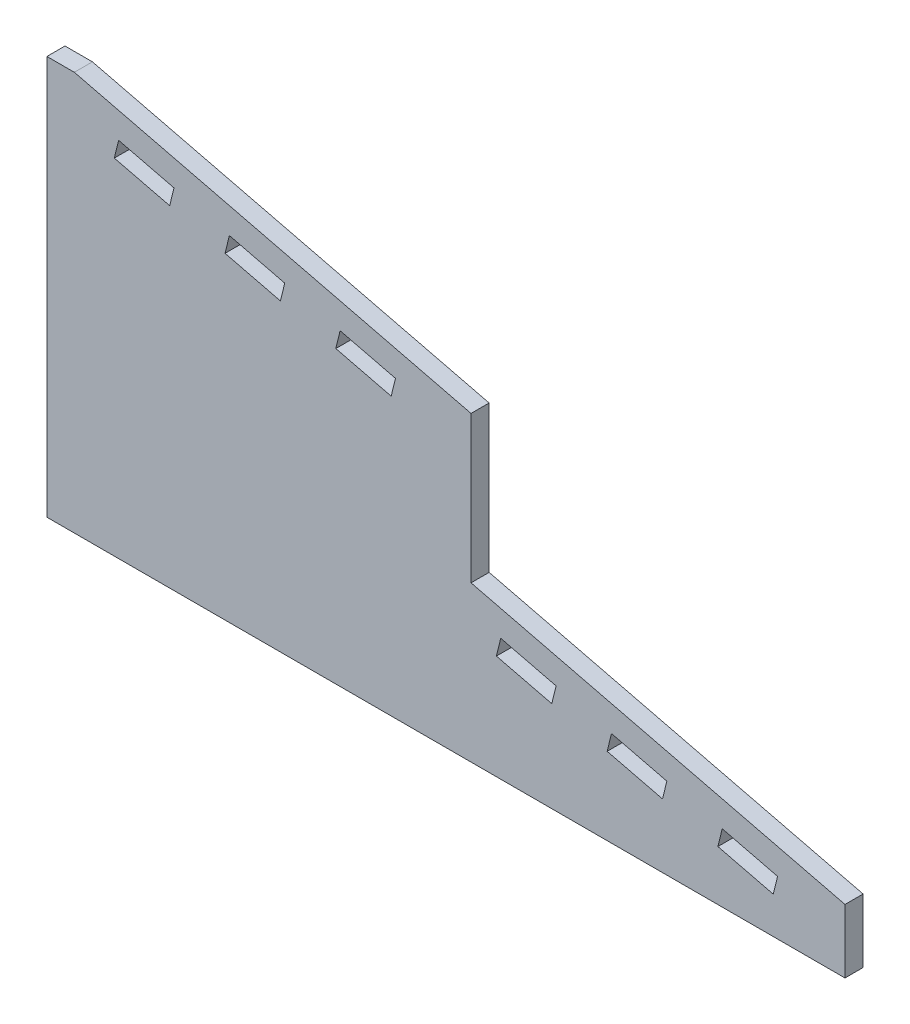
ISO-10303-21;
HEADER;
FILE_DESCRIPTION(('STEP AP214'),'2;1');
FILE_NAME('part.step','',(''),(''),'','','');
FILE_SCHEMA(('AUTOMOTIVE_DESIGN { 1 0 10303 214 1 1 1 1 }'));
ENDSEC;
DATA;
#1=APPLICATION_CONTEXT('core data for automotive mechanical design processes');
#2=APPLICATION_PROTOCOL_DEFINITION('international standard','automotive_design',2000,#1);
#3=PRODUCT_CONTEXT('',#1,'mechanical');
#4=PRODUCT('Part','Part','',(#3));
#5=PRODUCT_RELATED_PRODUCT_CATEGORY('part','',(#4));
#6=PRODUCT_DEFINITION_FORMATION('','',#4);
#7=PRODUCT_DEFINITION_CONTEXT('part definition',#1,'design');
#8=PRODUCT_DEFINITION('design','',#6,#7);
#9=PRODUCT_DEFINITION_SHAPE('','',#8);
#10=(LENGTH_UNIT() NAMED_UNIT(*) SI_UNIT(.MILLI.,.METRE.));
#11=(NAMED_UNIT(*) PLANE_ANGLE_UNIT() SI_UNIT($,.RADIAN.));
#12=(NAMED_UNIT(*) SI_UNIT($,.STERADIAN.) SOLID_ANGLE_UNIT());
#13=UNCERTAINTY_MEASURE_WITH_UNIT(LENGTH_MEASURE(1.E-05),#10,'distance_accuracy_value','');
#14=(GEOMETRIC_REPRESENTATION_CONTEXT(3) GLOBAL_UNCERTAINTY_ASSIGNED_CONTEXT((#13)) GLOBAL_UNIT_ASSIGNED_CONTEXT((#10,
#11,#12)) REPRESENTATION_CONTEXT('',''));
#15=CARTESIAN_POINT('',(0.,0.,0.));
#16=DIRECTION('',(0.,0.,1.));
#17=DIRECTION('',(1.,0.,0.));
#18=AXIS2_PLACEMENT_3D('',#15,#16,#17);
#19=CARTESIAN_POINT('',(0.,0.,3.175));
#20=DIRECTION('',(1.,0.,0.));
#21=DIRECTION('',(0.,0.,-1.));
#22=AXIS2_PLACEMENT_3D('',#19,#20,#21);
#23=PLANE('',#22);
#24=DIRECTION('',(0.,-1.,0.));
#25=VECTOR('',#24,1.);
#26=CARTESIAN_POINT('',(0.,0.,0.));
#27=LINE('',#26,#25);
#28=CARTESIAN_POINT('',(0.,70.,0.));
#29=VERTEX_POINT('',#28);
#30=CARTESIAN_POINT('',(0.,0.,0.));
#31=VERTEX_POINT('',#30);
#32=EDGE_CURVE('E264',#29,#31,#27,.T.);
#33=ORIENTED_EDGE('',*,*,#32,.T.);
#34=DIRECTION('',(0.,0.,-1.));
#35=VECTOR('',#34,1.);
#36=CARTESIAN_POINT('',(0.,0.,3.175));
#37=LINE('',#36,#35);
#38=CARTESIAN_POINT('',(0.,0.,3.175));
#39=VERTEX_POINT('',#38);
#40=EDGE_CURVE('E11',#39,#31,#37,.T.);
#41=ORIENTED_EDGE('',*,*,#40,.F.);
#42=DIRECTION('',(0.,-1.,0.));
#43=VECTOR('',#42,1.);
#44=CARTESIAN_POINT('',(0.,0.,3.175));
#45=LINE('',#44,#43);
#46=CARTESIAN_POINT('',(0.,70.,3.175));
#47=VERTEX_POINT('',#46);
#48=EDGE_CURVE('E262',#47,#39,#45,.T.);
#49=ORIENTED_EDGE('',*,*,#48,.F.);
#50=DIRECTION('',(0.,0.,-1.));
#51=VECTOR('',#50,1.);
#52=CARTESIAN_POINT('',(0.,70.,3.175));
#53=LINE('',#52,#51);
#54=EDGE_CURVE('E268',#47,#29,#53,.T.);
#55=ORIENTED_EDGE('',*,*,#54,.T.);
#56=EDGE_LOOP('',(#33,#41,#49,#55));
#57=FACE_BOUND('',#56,.T.);
#58=ADVANCED_FACE('F33',(#57),#23,.F.);
#59=CARTESIAN_POINT('',(0.,0.,3.175));
#60=DIRECTION('',(0.,1.,0.));
#61=DIRECTION('',(0.,0.,1.));
#62=AXIS2_PLACEMENT_3D('',#59,#60,#61);
#63=PLANE('',#62);
#64=DIRECTION('',(1.,0.,0.));
#65=VECTOR('',#64,1.);
#66=CARTESIAN_POINT('',(0.,0.,0.));
#67=LINE('',#66,#65);
#68=CARTESIAN_POINT('',(140.,0.,0.));
#69=VERTEX_POINT('',#68);
#70=EDGE_CURVE('E260',#31,#69,#67,.T.);
#71=ORIENTED_EDGE('',*,*,#70,.T.);
#72=DIRECTION('',(0.,0.,-1.));
#73=VECTOR('',#72,1.);
#74=CARTESIAN_POINT('',(140.,0.,3.175));
#75=LINE('',#74,#73);
#76=CARTESIAN_POINT('',(140.,0.,3.175));
#77=VERTEX_POINT('',#76);
#78=EDGE_CURVE('E40',#77,#69,#75,.T.);
#79=ORIENTED_EDGE('',*,*,#78,.F.);
#80=DIRECTION('',(1.,0.,0.));
#81=VECTOR('',#80,1.);
#82=CARTESIAN_POINT('',(0.,0.,3.175));
#83=LINE('',#82,#81);
#84=EDGE_CURVE('E282',#39,#77,#83,.T.);
#85=ORIENTED_EDGE('',*,*,#84,.F.);
#86=ORIENTED_EDGE('',*,*,#40,.T.);
#87=EDGE_LOOP('',(#71,#79,#85,#86));
#88=FACE_BOUND('',#87,.T.);
#89=ADVANCED_FACE('F464',(#88),#63,.F.);
#90=CARTESIAN_POINT('',(140.,0.,3.175));
#91=DIRECTION('',(-1.,0.,0.));
#92=DIRECTION('',(0.,0.,1.));
#93=AXIS2_PLACEMENT_3D('',#90,#91,#92);
#94=PLANE('',#93);
#95=DIRECTION('',(0.,1.,0.));
#96=VECTOR('',#95,1.);
#97=CARTESIAN_POINT('',(140.,0.,0.));
#98=LINE('',#97,#96);
#99=CARTESIAN_POINT('',(140.,11.177065891492,0.));
#100=VERTEX_POINT('',#99);
#101=EDGE_CURVE('E251',#69,#100,#98,.T.);
#102=ORIENTED_EDGE('',*,*,#101,.T.);
#103=DIRECTION('',(0.,0.,1.));
#104=VECTOR('',#103,1.);
#105=CARTESIAN_POINT('',(140.,11.177065891492,0.));
#106=LINE('',#105,#104);
#107=CARTESIAN_POINT('',(140.,11.177065891492,3.175));
#108=VERTEX_POINT('',#107);
#109=EDGE_CURVE('E235',#100,#108,#106,.T.);
#110=ORIENTED_EDGE('',*,*,#109,.T.);
#111=DIRECTION('',(0.,1.,0.));
#112=VECTOR('',#111,1.);
#113=CARTESIAN_POINT('',(140.,0.,3.175));
#114=LINE('',#113,#112);
#115=EDGE_CURVE('E276',#77,#108,#114,.T.);
#116=ORIENTED_EDGE('',*,*,#115,.F.);
#117=ORIENTED_EDGE('',*,*,#78,.T.);
#118=EDGE_LOOP('',(#102,#110,#116,#117));
#119=FACE_BOUND('',#118,.T.);
#120=ADVANCED_FACE('F257',(#119),#94,.F.);
#121=CARTESIAN_POINT('',(0.,70.,3.175));
#122=DIRECTION('',(0.,-1.,0.));
#123=DIRECTION('',(0.,0.,-1.));
#124=AXIS2_PLACEMENT_3D('',#121,#122,#123);
#125=PLANE('',#124);
#126=DIRECTION('',(-1.,0.,0.));
#127=VECTOR('',#126,1.);
#128=CARTESIAN_POINT('',(0.,70.,3.175));
#129=LINE('',#128,#127);
#130=CARTESIAN_POINT('',(4.80964743633403,70.,3.175));
#131=VERTEX_POINT('',#130);
#132=EDGE_CURVE('E270',#131,#47,#129,.T.);
#133=ORIENTED_EDGE('',*,*,#132,.F.);
#134=DIRECTION('',(0.,0.,1.));
#135=VECTOR('',#134,1.);
#136=CARTESIAN_POINT('',(4.80964743633403,70.,0.));
#137=LINE('',#136,#135);
#138=CARTESIAN_POINT('',(4.80964743633403,70.,0.));
#139=VERTEX_POINT('',#138);
#140=EDGE_CURVE('E245',#139,#131,#137,.T.);
#141=ORIENTED_EDGE('',*,*,#140,.F.);
#142=DIRECTION('',(-1.,0.,0.));
#143=VECTOR('',#142,1.);
#144=CARTESIAN_POINT('',(0.,70.,0.));
#145=LINE('',#144,#143);
#146=EDGE_CURVE('E259',#139,#29,#145,.T.);
#147=ORIENTED_EDGE('',*,*,#146,.T.);
#148=ORIENTED_EDGE('',*,*,#54,.F.);
#149=EDGE_LOOP('',(#133,#141,#147,#148));
#150=FACE_BOUND('',#149,.T.);
#151=ADVANCED_FACE('F468',(#150),#125,.F.);
#152=CARTESIAN_POINT('',(0.,0.,3.175));
#153=DIRECTION('',(0.,0.,-1.));
#154=DIRECTION('',(-1.,0.,0.));
#155=AXIS2_PLACEMENT_3D('',#152,#153,#154);
#156=PLANE('',#155);
#157=DIRECTION('',(-0.237714979344397,-0.971334951803595,0.));
#158=VECTOR('',#157,1.);
#159=CARTESIAN_POINT('',(12.5797173555219,63.5557121683706,3.175));
#160=LINE('',#159,#158);
#161=CARTESIAN_POINT('',(12.5797173555219,63.5557121683706,3.175));
#162=VERTEX_POINT('',#161);
#163=CARTESIAN_POINT('',(11.8249722961035,60.4717236963942,3.175));
#164=VERTEX_POINT('',#163);
#165=EDGE_CURVE('E488',#162,#164,#160,.T.);
#166=ORIENTED_EDGE('',*,*,#165,.F.);
#167=DIRECTION('',(-0.971334951803595,0.237714979344397,0.));
#168=VECTOR('',#167,1.);
#169=CARTESIAN_POINT('',(22.2930668735579,61.1785623749266,3.175));
#170=LINE('',#169,#168);
#171=CARTESIAN_POINT('',(22.2930668735579,61.1785623749266,3.175));
#172=VERTEX_POINT('',#171);
#173=EDGE_CURVE('E55',#172,#162,#170,.T.);
#174=ORIENTED_EDGE('',*,*,#173,.F.);
#175=DIRECTION('',(0.237714979344397,0.971334951803595,0.));
#176=VECTOR('',#175,1.);
#177=CARTESIAN_POINT('',(21.5383218141394,58.0945739029502,3.175));
#178=LINE('',#177,#176);
#179=CARTESIAN_POINT('',(21.5383218141394,58.0945739029502,3.175));
#180=VERTEX_POINT('',#179);
#181=EDGE_CURVE('E294',#180,#172,#178,.T.);
#182=ORIENTED_EDGE('',*,*,#181,.F.);
#183=DIRECTION('',(0.971334951803595,-0.237714979344397,0.));
#184=VECTOR('',#183,1.);
#185=CARTESIAN_POINT('',(11.8249722961035,60.4717236963942,3.175));
#186=LINE('',#185,#184);
#187=EDGE_CURVE('E490',#164,#180,#186,.T.);
#188=ORIENTED_EDGE('',*,*,#187,.F.);
#189=EDGE_LOOP('',(#166,#174,#182,#188));
#190=FACE_BOUND('',#189,.T.);
#191=DIRECTION('',(-0.237714979344392,-0.971334951803597,0.));
#192=VECTOR('',#191,1.);
#193=CARTESIAN_POINT('',(78.8535350542985,18.3300367988493,3.175));
#194=LINE('',#193,#192);
#195=CARTESIAN_POINT('',(79.6082801137169,21.4140252708257,3.175));
#196=VERTEX_POINT('',#195);
#197=CARTESIAN_POINT('',(78.8535350542985,18.3300367988493,3.175));
#198=VERTEX_POINT('',#197);
#199=EDGE_CURVE('E317',#196,#198,#194,.T.);
#200=ORIENTED_EDGE('',*,*,#199,.F.);
#201=DIRECTION('',(-0.971334951803595,0.237714979344397,0.));
#202=VECTOR('',#201,1.);
#203=CARTESIAN_POINT('',(79.6082801137169,21.4140252708257,3.175));
#204=LINE('',#203,#202);
#205=CARTESIAN_POINT('',(89.3216296317529,19.0368754773817,3.175));
#206=VERTEX_POINT('',#205);
#207=EDGE_CURVE('E315',#206,#196,#204,.T.);
#208=ORIENTED_EDGE('',*,*,#207,.F.);
#209=DIRECTION('',(0.2377149793444,0.971334951803595,0.));
#210=VECTOR('',#209,1.);
#211=CARTESIAN_POINT('',(89.3216296317529,19.0368754773817,3.175));
#212=LINE('',#211,#210);
#213=CARTESIAN_POINT('',(88.5668845723344,15.9528870054053,3.175));
#214=VERTEX_POINT('',#213);
#215=EDGE_CURVE('E305',#214,#206,#212,.T.);
#216=ORIENTED_EDGE('',*,*,#215,.F.);
#217=DIRECTION('',(0.971334951803595,-0.237714979344398,0.));
#218=VECTOR('',#217,1.);
#219=CARTESIAN_POINT('',(88.5668845723344,15.9528870054053,3.175));
#220=LINE('',#219,#218);
#221=EDGE_CURVE('E321',#198,#214,#220,.T.);
#222=ORIENTED_EDGE('',*,*,#221,.F.);
#223=EDGE_LOOP('',(#200,#208,#216,#222));
#224=FACE_BOUND('',#223,.T.);
#225=DIRECTION('',(-0.2377149793444,-0.971334951803595,0.));
#226=VECTOR('',#225,1.);
#227=CARTESIAN_POINT('',(98.2802340903703,13.5757372119613,3.175));
#228=LINE('',#227,#226);
#229=CARTESIAN_POINT('',(99.0349791497888,16.6597256839377,3.175));
#230=VERTEX_POINT('',#229);
#231=CARTESIAN_POINT('',(98.2802340903703,13.5757372119613,3.175));
#232=VERTEX_POINT('',#231);
#233=EDGE_CURVE('E447',#230,#232,#228,.T.);
#234=ORIENTED_EDGE('',*,*,#233,.F.);
#235=DIRECTION('',(-0.971334951803595,0.237714979344398,0.));
#236=VECTOR('',#235,1.);
#237=CARTESIAN_POINT('',(99.0349791497888,16.6597256839377,3.175));
#238=LINE('',#237,#236);
#239=CARTESIAN_POINT('',(108.748328667825,14.2825758904938,3.175));
#240=VERTEX_POINT('',#239);
#241=EDGE_CURVE('E328',#240,#230,#238,.T.);
#242=ORIENTED_EDGE('',*,*,#241,.F.);
#243=DIRECTION('',(0.237714979344396,0.971334951803596,0.));
#244=VECTOR('',#243,1.);
#245=CARTESIAN_POINT('',(108.748328667825,14.2825758904938,3.175));
#246=LINE('',#245,#244);
#247=CARTESIAN_POINT('',(107.993583608406,11.1985874185173,3.175));
#248=VERTEX_POINT('',#247);
#249=EDGE_CURVE('E436',#248,#240,#246,.T.);
#250=ORIENTED_EDGE('',*,*,#249,.F.);
#251=DIRECTION('',(0.971334951803595,-0.237714979344397,0.));
#252=VECTOR('',#251,1.);
#253=CARTESIAN_POINT('',(107.993583608406,11.1985874185173,3.175));
#254=LINE('',#253,#252);
#255=EDGE_CURVE('E450',#232,#248,#254,.T.);
#256=ORIENTED_EDGE('',*,*,#255,.F.);
#257=EDGE_LOOP('',(#234,#242,#250,#256));
#258=FACE_BOUND('',#257,.T.);
#259=DIRECTION('',(0.971334951803595,-0.237714979344397,0.));
#260=VECTOR('',#259,1.);
#261=CARTESIAN_POINT('',(127.420282644478,6.44428783162938,3.175));
#262=LINE('',#261,#260);
#263=CARTESIAN_POINT('',(117.706933126442,8.82143762507336,3.175));
#264=VERTEX_POINT('',#263);
#265=CARTESIAN_POINT('',(127.420282644478,6.44428783162938,3.175));
#266=VERTEX_POINT('',#265);
#267=EDGE_CURVE('E416',#264,#266,#262,.T.);
#268=ORIENTED_EDGE('',*,*,#267,.F.);
#269=DIRECTION('',(-0.237714979344396,-0.971334951803596,0.));
#270=VECTOR('',#269,1.);
#271=CARTESIAN_POINT('',(117.706933126442,8.82143762507336,3.175));
#272=LINE('',#271,#270);
#273=CARTESIAN_POINT('',(118.461678185861,11.9054260970498,3.175));
#274=VERTEX_POINT('',#273);
#275=EDGE_CURVE('E414',#274,#264,#272,.T.);
#276=ORIENTED_EDGE('',*,*,#275,.F.);
#277=DIRECTION('',(-0.971334951803595,0.237714979344397,0.));
#278=VECTOR('',#277,1.);
#279=CARTESIAN_POINT('',(118.461678185861,11.9054260970498,3.175));
#280=LINE('',#279,#278);
#281=CARTESIAN_POINT('',(128.175027703897,9.5282763036058,3.175));
#282=VERTEX_POINT('',#281);
#283=EDGE_CURVE('E404',#282,#274,#280,.T.);
#284=ORIENTED_EDGE('',*,*,#283,.F.);
#285=DIRECTION('',(0.2377149793444,0.971334951803595,0.));
#286=VECTOR('',#285,1.);
#287=CARTESIAN_POINT('',(128.175027703897,9.5282763036058,3.175));
#288=LINE('',#287,#286);
#289=EDGE_CURVE('E420',#266,#282,#288,.T.);
#290=ORIENTED_EDGE('',*,*,#289,.F.);
#291=EDGE_LOOP('',(#268,#276,#284,#290));
#292=FACE_BOUND('',#291,.T.);
#293=DIRECTION('',(0.971334951803595,-0.237714979344397,0.));
#294=VECTOR('',#293,1.);
#295=CARTESIAN_POINT('',(50.6783703682471,50.9631245226183,3.175));
#296=LINE('',#295,#294);
#297=CARTESIAN_POINT('',(50.6783703682471,50.9631245226183,3.175));
#298=VERTEX_POINT('',#297);
#299=CARTESIAN_POINT('',(60.391719886283,48.5859747291743,3.175));
#300=VERTEX_POINT('',#299);
#301=EDGE_CURVE('E384',#298,#300,#296,.T.);
#302=ORIENTED_EDGE('',*,*,#301,.F.);
#303=DIRECTION('',(-0.237714979344398,-0.971334951803595,0.));
#304=VECTOR('',#303,1.);
#305=CARTESIAN_POINT('',(51.4331154276655,54.0471129945947,3.175));
#306=LINE('',#305,#304);
#307=CARTESIAN_POINT('',(51.4331154276655,54.0471129945947,3.175));
#308=VERTEX_POINT('',#307);
#309=EDGE_CURVE('E382',#308,#298,#306,.T.);
#310=ORIENTED_EDGE('',*,*,#309,.F.);
#311=DIRECTION('',(-0.971334951803595,0.237714979344397,0.));
#312=VECTOR('',#311,1.);
#313=CARTESIAN_POINT('',(61.1464649457015,51.6699632011508,3.175));
#314=LINE('',#313,#312);
#315=CARTESIAN_POINT('',(61.1464649457015,51.6699632011508,3.175));
#316=VERTEX_POINT('',#315);
#317=EDGE_CURVE('E372',#316,#308,#314,.T.);
#318=ORIENTED_EDGE('',*,*,#317,.F.);
#319=DIRECTION('',(0.237714979344396,0.971334951803596,0.));
#320=VECTOR('',#319,1.);
#321=CARTESIAN_POINT('',(60.391719886283,48.5859747291743,3.175));
#322=LINE('',#321,#320);
#323=EDGE_CURVE('E388',#300,#316,#322,.T.);
#324=ORIENTED_EDGE('',*,*,#323,.F.);
#325=EDGE_LOOP('',(#302,#310,#318,#324));
#326=FACE_BOUND('',#325,.T.);
#327=DIRECTION('',(0.971334951803595,-0.237714979344398,0.));
#328=VECTOR('',#327,1.);
#329=CARTESIAN_POINT('',(31.2516713321753,55.7174241095063,3.175));
#330=LINE('',#329,#328);
#331=CARTESIAN_POINT('',(31.2516713321753,55.7174241095063,3.175));
#332=VERTEX_POINT('',#331);
#333=CARTESIAN_POINT('',(40.9650208502112,53.3402743160623,3.175));
#334=VERTEX_POINT('',#333);
#335=EDGE_CURVE('E351',#332,#334,#330,.T.);
#336=ORIENTED_EDGE('',*,*,#335,.F.);
#337=DIRECTION('',(-0.237714979344399,-0.971334951803595,0.));
#338=VECTOR('',#337,1.);
#339=CARTESIAN_POINT('',(32.0064163915937,58.8014125814827,3.175));
#340=LINE('',#339,#338);
#341=CARTESIAN_POINT('',(32.0064163915937,58.8014125814827,3.175));
#342=VERTEX_POINT('',#341);
#343=EDGE_CURVE('E349',#342,#332,#340,.T.);
#344=ORIENTED_EDGE('',*,*,#343,.F.);
#345=DIRECTION('',(-0.971334951803595,0.237714979344397,0.));
#346=VECTOR('',#345,1.);
#347=CARTESIAN_POINT('',(41.7197659096297,56.4242627880387,3.175));
#348=LINE('',#347,#346);
#349=CARTESIAN_POINT('',(41.7197659096297,56.4242627880387,3.175));
#350=VERTEX_POINT('',#349);
#351=EDGE_CURVE('E339',#350,#342,#348,.T.);
#352=ORIENTED_EDGE('',*,*,#351,.F.);
#353=DIRECTION('',(0.237714979344396,0.971334951803595,0.));
#354=VECTOR('',#353,1.);
#355=CARTESIAN_POINT('',(40.9650208502112,53.3402743160623,3.175));
#356=LINE('',#355,#354);
#357=EDGE_CURVE('E355',#334,#350,#356,.T.);
#358=ORIENTED_EDGE('',*,*,#357,.F.);
#359=EDGE_LOOP('',(#336,#344,#352,#358));
#360=FACE_BOUND('',#359,.T.);
#361=ORIENTED_EDGE('',*,*,#115,.T.);
#362=DIRECTION('',(0.971334951803595,-0.237714979344398,0.));
#363=VECTOR('',#362,1.);
#364=CARTESIAN_POINT('',(74.3977271178714,27.2319220604832,3.175));
#365=LINE('',#364,#363);
#366=CARTESIAN_POINT('',(74.3977271178714,27.2319220604832,3.175));
#367=VERTEX_POINT('',#366);
#368=EDGE_CURVE('E240',#367,#108,#365,.T.);
#369=ORIENTED_EDGE('',*,*,#368,.F.);
#370=DIRECTION('',(0.,-1.,0.));
#371=VECTOR('',#370,1.);
#372=CARTESIAN_POINT('',(74.3977271178714,52.9696966083665,3.175));
#373=LINE('',#372,#371);
#374=CARTESIAN_POINT('',(74.3977271178714,52.9696966083665,3.175));
#375=VERTEX_POINT('',#374);
#376=EDGE_CURVE('E254',#375,#367,#373,.T.);
#377=ORIENTED_EDGE('',*,*,#376,.F.);
#378=DIRECTION('',(0.971334951803595,-0.237714979344398,0.));
#379=VECTOR('',#378,1.);
#380=CARTESIAN_POINT('',(4.80964743633403,70.,3.175));
#381=LINE('',#380,#379);
#382=EDGE_CURVE('E676',#131,#375,#381,.T.);
#383=ORIENTED_EDGE('',*,*,#382,.F.);
#384=ORIENTED_EDGE('',*,*,#132,.T.);
#385=ORIENTED_EDGE('',*,*,#48,.T.);
#386=ORIENTED_EDGE('',*,*,#84,.T.);
#387=EDGE_LOOP('',(#361,#369,#377,#383,#384,#385,#386));
#388=FACE_BOUND('',#387,.T.);
#389=ADVANCED_FACE('F462',(#190,#224,#258,#292,#326,#360,#388),#156,.F.);
#390=CARTESIAN_POINT('',(0.,0.,0.));
#391=DIRECTION('',(0.,0.,-1.));
#392=DIRECTION('',(-1.,0.,0.));
#393=AXIS2_PLACEMENT_3D('',#390,#391,#392);
#394=PLANE('',#393);
#395=DIRECTION('',(0.971334951803595,-0.237714979344398,0.));
#396=VECTOR('',#395,1.);
#397=CARTESIAN_POINT('',(74.3977271178714,27.2319220604832,0.));
#398=LINE('',#397,#396);
#399=CARTESIAN_POINT('',(74.3977271178714,27.2319220604832,0.));
#400=VERTEX_POINT('',#399);
#401=EDGE_CURVE('E238',#400,#100,#398,.T.);
#402=ORIENTED_EDGE('',*,*,#401,.T.);
#403=ORIENTED_EDGE('',*,*,#101,.F.);
#404=ORIENTED_EDGE('',*,*,#70,.F.);
#405=ORIENTED_EDGE('',*,*,#32,.F.);
#406=ORIENTED_EDGE('',*,*,#146,.F.);
#407=DIRECTION('',(0.971334951803595,-0.237714979344398,0.));
#408=VECTOR('',#407,1.);
#409=CARTESIAN_POINT('',(4.80964743633403,70.,0.));
#410=LINE('',#409,#408);
#411=CARTESIAN_POINT('',(74.3977271178714,52.9696966083665,0.));
#412=VERTEX_POINT('',#411);
#413=EDGE_CURVE('E253',#139,#412,#410,.T.);
#414=ORIENTED_EDGE('',*,*,#413,.T.);
#415=DIRECTION('',(0.,-1.,0.));
#416=VECTOR('',#415,1.);
#417=CARTESIAN_POINT('',(74.3977271178714,52.9696966083665,0.));
#418=LINE('',#417,#416);
#419=EDGE_CURVE('E47',#412,#400,#418,.T.);
#420=ORIENTED_EDGE('',*,*,#419,.T.);
#421=EDGE_LOOP('',(#402,#403,#404,#405,#406,#414,#420));
#422=FACE_BOUND('',#421,.T.);
#423=DIRECTION('',(-0.971334951803595,0.237714979344397,0.));
#424=VECTOR('',#423,1.);
#425=CARTESIAN_POINT('',(22.2930668735579,61.1785623749266,0.));
#426=LINE('',#425,#424);
#427=CARTESIAN_POINT('',(22.2930668735579,61.1785623749266,0.));
#428=VERTEX_POINT('',#427);
#429=CARTESIAN_POINT('',(12.5797173555219,63.5557121683706,0.));
#430=VERTEX_POINT('',#429);
#431=EDGE_CURVE('E476',#428,#430,#426,.T.);
#432=ORIENTED_EDGE('',*,*,#431,.T.);
#433=DIRECTION('',(-0.237714979344397,-0.971334951803595,0.));
#434=VECTOR('',#433,1.);
#435=CARTESIAN_POINT('',(12.5797173555219,63.5557121683706,0.));
#436=LINE('',#435,#434);
#437=CARTESIAN_POINT('',(11.8249722961035,60.4717236963942,0.));
#438=VERTEX_POINT('',#437);
#439=EDGE_CURVE('E479',#430,#438,#436,.T.);
#440=ORIENTED_EDGE('',*,*,#439,.T.);
#441=DIRECTION('',(0.971334951803595,-0.237714979344397,0.));
#442=VECTOR('',#441,1.);
#443=CARTESIAN_POINT('',(11.8249722961035,60.4717236963942,0.));
#444=LINE('',#443,#442);
#445=CARTESIAN_POINT('',(21.5383218141394,58.0945739029502,0.));
#446=VERTEX_POINT('',#445);
#447=EDGE_CURVE('E482',#438,#446,#444,.T.);
#448=ORIENTED_EDGE('',*,*,#447,.T.);
#449=DIRECTION('',(0.237714979344397,0.971334951803595,0.));
#450=VECTOR('',#449,1.);
#451=CARTESIAN_POINT('',(21.5383218141394,58.0945739029502,0.));
#452=LINE('',#451,#450);
#453=EDGE_CURVE('E300',#446,#428,#452,.T.);
#454=ORIENTED_EDGE('',*,*,#453,.T.);
#455=EDGE_LOOP('',(#432,#440,#448,#454));
#456=FACE_BOUND('',#455,.T.);
#457=DIRECTION('',(-0.971334951803595,0.237714979344397,0.));
#458=VECTOR('',#457,1.);
#459=CARTESIAN_POINT('',(79.6082801137169,21.4140252708257,0.));
#460=LINE('',#459,#458);
#461=CARTESIAN_POINT('',(89.3216296317529,19.0368754773817,0.));
#462=VERTEX_POINT('',#461);
#463=CARTESIAN_POINT('',(79.6082801137169,21.4140252708257,0.));
#464=VERTEX_POINT('',#463);
#465=EDGE_CURVE('E301',#462,#464,#460,.T.);
#466=ORIENTED_EDGE('',*,*,#465,.T.);
#467=DIRECTION('',(-0.237714979344392,-0.971334951803597,0.));
#468=VECTOR('',#467,1.);
#469=CARTESIAN_POINT('',(78.8535350542985,18.3300367988493,0.));
#470=LINE('',#469,#468);
#471=CARTESIAN_POINT('',(78.8535350542985,18.3300367988493,0.));
#472=VERTEX_POINT('',#471);
#473=EDGE_CURVE('E304',#464,#472,#470,.T.);
#474=ORIENTED_EDGE('',*,*,#473,.T.);
#475=DIRECTION('',(0.971334951803595,-0.237714979344398,0.));
#476=VECTOR('',#475,1.);
#477=CARTESIAN_POINT('',(88.5668845723344,15.9528870054053,0.));
#478=LINE('',#477,#476);
#479=CARTESIAN_POINT('',(88.5668845723344,15.9528870054053,0.));
#480=VERTEX_POINT('',#479);
#481=EDGE_CURVE('E308',#472,#480,#478,.T.);
#482=ORIENTED_EDGE('',*,*,#481,.T.);
#483=DIRECTION('',(0.2377149793444,0.971334951803595,0.));
#484=VECTOR('',#483,1.);
#485=CARTESIAN_POINT('',(89.3216296317529,19.0368754773817,0.));
#486=LINE('',#485,#484);
#487=EDGE_CURVE('E311',#480,#462,#486,.T.);
#488=ORIENTED_EDGE('',*,*,#487,.T.);
#489=EDGE_LOOP('',(#466,#474,#482,#488));
#490=FACE_BOUND('',#489,.T.);
#491=DIRECTION('',(-0.971334951803595,0.237714979344398,0.));
#492=VECTOR('',#491,1.);
#493=CARTESIAN_POINT('',(99.0349791497888,16.6597256839377,0.));
#494=LINE('',#493,#492);
#495=CARTESIAN_POINT('',(108.748328667825,14.2825758904938,0.));
#496=VERTEX_POINT('',#495);
#497=CARTESIAN_POINT('',(99.0349791497888,16.6597256839377,0.));
#498=VERTEX_POINT('',#497);
#499=EDGE_CURVE('E432',#496,#498,#494,.T.);
#500=ORIENTED_EDGE('',*,*,#499,.T.);
#501=DIRECTION('',(-0.2377149793444,-0.971334951803595,0.));
#502=VECTOR('',#501,1.);
#503=CARTESIAN_POINT('',(98.2802340903703,13.5757372119613,0.));
#504=LINE('',#503,#502);
#505=CARTESIAN_POINT('',(98.2802340903703,13.5757372119613,0.));
#506=VERTEX_POINT('',#505);
#507=EDGE_CURVE('E435',#498,#506,#504,.T.);
#508=ORIENTED_EDGE('',*,*,#507,.T.);
#509=DIRECTION('',(0.971334951803595,-0.237714979344397,0.));
#510=VECTOR('',#509,1.);
#511=CARTESIAN_POINT('',(107.993583608406,11.1985874185173,0.));
#512=LINE('',#511,#510);
#513=CARTESIAN_POINT('',(107.993583608406,11.1985874185173,0.));
#514=VERTEX_POINT('',#513);
#515=EDGE_CURVE('E439',#506,#514,#512,.T.);
#516=ORIENTED_EDGE('',*,*,#515,.T.);
#517=DIRECTION('',(0.237714979344396,0.971334951803596,0.));
#518=VECTOR('',#517,1.);
#519=CARTESIAN_POINT('',(108.748328667825,14.2825758904938,0.));
#520=LINE('',#519,#518);
#521=EDGE_CURVE('E442',#514,#496,#520,.T.);
#522=ORIENTED_EDGE('',*,*,#521,.T.);
#523=EDGE_LOOP('',(#500,#508,#516,#522));
#524=FACE_BOUND('',#523,.T.);
#525=DIRECTION('',(-0.237714979344396,-0.971334951803596,0.));
#526=VECTOR('',#525,1.);
#527=CARTESIAN_POINT('',(117.706933126442,8.82143762507336,0.));
#528=LINE('',#527,#526);
#529=CARTESIAN_POINT('',(118.461678185861,11.9054260970498,0.));
#530=VERTEX_POINT('',#529);
#531=CARTESIAN_POINT('',(117.706933126442,8.82143762507336,0.));
#532=VERTEX_POINT('',#531);
#533=EDGE_CURVE('E400',#530,#532,#528,.T.);
#534=ORIENTED_EDGE('',*,*,#533,.T.);
#535=DIRECTION('',(0.971334951803595,-0.237714979344397,0.));
#536=VECTOR('',#535,1.);
#537=CARTESIAN_POINT('',(127.420282644478,6.44428783162938,0.));
#538=LINE('',#537,#536);
#539=CARTESIAN_POINT('',(127.420282644478,6.44428783162939,0.));
#540=VERTEX_POINT('',#539);
#541=EDGE_CURVE('E403',#532,#540,#538,.T.);
#542=ORIENTED_EDGE('',*,*,#541,.T.);
#543=DIRECTION('',(0.2377149793444,0.971334951803595,0.));
#544=VECTOR('',#543,1.);
#545=CARTESIAN_POINT('',(128.175027703897,9.5282763036058,0.));
#546=LINE('',#545,#544);
#547=CARTESIAN_POINT('',(128.175027703897,9.5282763036058,0.));
#548=VERTEX_POINT('',#547);
#549=EDGE_CURVE('E407',#540,#548,#546,.T.);
#550=ORIENTED_EDGE('',*,*,#549,.T.);
#551=DIRECTION('',(-0.971334951803595,0.237714979344397,0.));
#552=VECTOR('',#551,1.);
#553=CARTESIAN_POINT('',(118.461678185861,11.9054260970498,0.));
#554=LINE('',#553,#552);
#555=EDGE_CURVE('E410',#548,#530,#554,.T.);
#556=ORIENTED_EDGE('',*,*,#555,.T.);
#557=EDGE_LOOP('',(#534,#542,#550,#556));
#558=FACE_BOUND('',#557,.T.);
#559=DIRECTION('',(-0.237714979344398,-0.971334951803595,0.));
#560=VECTOR('',#559,1.);
#561=CARTESIAN_POINT('',(51.4331154276655,54.0471129945947,0.));
#562=LINE('',#561,#560);
#563=CARTESIAN_POINT('',(51.4331154276655,54.0471129945947,0.));
#564=VERTEX_POINT('',#563);
#565=CARTESIAN_POINT('',(50.6783703682471,50.9631245226183,0.));
#566=VERTEX_POINT('',#565);
#567=EDGE_CURVE('E368',#564,#566,#562,.T.);
#568=ORIENTED_EDGE('',*,*,#567,.T.);
#569=DIRECTION('',(0.971334951803595,-0.237714979344397,0.));
#570=VECTOR('',#569,1.);
#571=CARTESIAN_POINT('',(50.6783703682471,50.9631245226183,0.));
#572=LINE('',#571,#570);
#573=CARTESIAN_POINT('',(60.391719886283,48.5859747291743,0.));
#574=VERTEX_POINT('',#573);
#575=EDGE_CURVE('E371',#566,#574,#572,.T.);
#576=ORIENTED_EDGE('',*,*,#575,.T.);
#577=DIRECTION('',(0.237714979344396,0.971334951803596,0.));
#578=VECTOR('',#577,1.);
#579=CARTESIAN_POINT('',(60.391719886283,48.5859747291743,0.));
#580=LINE('',#579,#578);
#581=CARTESIAN_POINT('',(61.1464649457015,51.6699632011508,0.));
#582=VERTEX_POINT('',#581);
#583=EDGE_CURVE('E375',#574,#582,#580,.T.);
#584=ORIENTED_EDGE('',*,*,#583,.T.);
#585=DIRECTION('',(-0.971334951803595,0.237714979344397,0.));
#586=VECTOR('',#585,1.);
#587=CARTESIAN_POINT('',(61.1464649457015,51.6699632011508,0.));
#588=LINE('',#587,#586);
#589=EDGE_CURVE('E378',#582,#564,#588,.T.);
#590=ORIENTED_EDGE('',*,*,#589,.T.);
#591=EDGE_LOOP('',(#568,#576,#584,#590));
#592=FACE_BOUND('',#591,.T.);
#593=DIRECTION('',(-0.237714979344399,-0.971334951803595,0.));
#594=VECTOR('',#593,1.);
#595=CARTESIAN_POINT('',(32.0064163915937,58.8014125814827,0.));
#596=LINE('',#595,#594);
#597=CARTESIAN_POINT('',(32.0064163915937,58.8014125814827,0.));
#598=VERTEX_POINT('',#597);
#599=CARTESIAN_POINT('',(31.2516713321753,55.7174241095063,0.));
#600=VERTEX_POINT('',#599);
#601=EDGE_CURVE('E335',#598,#600,#596,.T.);
#602=ORIENTED_EDGE('',*,*,#601,.T.);
#603=DIRECTION('',(0.971334951803595,-0.237714979344398,0.));
#604=VECTOR('',#603,1.);
#605=CARTESIAN_POINT('',(31.2516713321753,55.7174241095063,0.));
#606=LINE('',#605,#604);
#607=CARTESIAN_POINT('',(40.9650208502112,53.3402743160623,0.));
#608=VERTEX_POINT('',#607);
#609=EDGE_CURVE('E338',#600,#608,#606,.T.);
#610=ORIENTED_EDGE('',*,*,#609,.T.);
#611=DIRECTION('',(0.237714979344396,0.971334951803595,0.));
#612=VECTOR('',#611,1.);
#613=CARTESIAN_POINT('',(40.9650208502112,53.3402743160623,0.));
#614=LINE('',#613,#612);
#615=CARTESIAN_POINT('',(41.7197659096297,56.4242627880387,0.));
#616=VERTEX_POINT('',#615);
#617=EDGE_CURVE('E342',#608,#616,#614,.T.);
#618=ORIENTED_EDGE('',*,*,#617,.T.);
#619=DIRECTION('',(-0.971334951803595,0.237714979344397,0.));
#620=VECTOR('',#619,1.);
#621=CARTESIAN_POINT('',(41.7197659096297,56.4242627880387,0.));
#622=LINE('',#621,#620);
#623=EDGE_CURVE('E345',#616,#598,#622,.T.);
#624=ORIENTED_EDGE('',*,*,#623,.T.);
#625=EDGE_LOOP('',(#602,#610,#618,#624));
#626=FACE_BOUND('',#625,.T.);
#627=ADVANCED_FACE('F249',(#422,#456,#490,#524,#558,#592,#626),#394,.T.);
#628=CARTESIAN_POINT('',(32.0064163915937,58.8014125814827,0.));
#629=DIRECTION('',(-0.971334951803595,0.237714979344399,0.));
#630=DIRECTION('',(-0.237714979344399,-0.971334951803595,0.));
#631=AXIS2_PLACEMENT_3D('',#628,#629,#630);
#632=PLANE('',#631);
#633=ORIENTED_EDGE('',*,*,#343,.T.);
#634=DIRECTION('',(0.,0.,1.));
#635=VECTOR('',#634,1.);
#636=CARTESIAN_POINT('',(31.2516713321753,55.7174241095063,0.));
#637=LINE('',#636,#635);
#638=EDGE_CURVE('E348',#600,#332,#637,.T.);
#639=ORIENTED_EDGE('',*,*,#638,.F.);
#640=ORIENTED_EDGE('',*,*,#601,.F.);
#641=DIRECTION('',(0.,0.,1.));
#642=VECTOR('',#641,1.);
#643=CARTESIAN_POINT('',(32.0064163915937,58.8014125814827,0.));
#644=LINE('',#643,#642);
#645=EDGE_CURVE('E360',#598,#342,#644,.T.);
#646=ORIENTED_EDGE('',*,*,#645,.T.);
#647=EDGE_LOOP('',(#633,#639,#640,#646));
#648=FACE_BOUND('',#647,.T.);
#649=ADVANCED_FACE('F530',(#648),#632,.F.);
#650=CARTESIAN_POINT('',(41.7197659096297,56.4242627880387,0.));
#651=DIRECTION('',(0.237714979344397,0.971334951803595,0.));
#652=DIRECTION('',(-0.971334951803595,0.237714979344397,0.));
#653=AXIS2_PLACEMENT_3D('',#650,#651,#652);
#654=PLANE('',#653);
#655=ORIENTED_EDGE('',*,*,#351,.T.);
#656=ORIENTED_EDGE('',*,*,#645,.F.);
#657=ORIENTED_EDGE('',*,*,#623,.F.);
#658=DIRECTION('',(0.,0.,1.));
#659=VECTOR('',#658,1.);
#660=CARTESIAN_POINT('',(41.7197659096297,56.4242627880387,0.));
#661=LINE('',#660,#659);
#662=EDGE_CURVE('E362',#616,#350,#661,.T.);
#663=ORIENTED_EDGE('',*,*,#662,.T.);
#664=EDGE_LOOP('',(#655,#656,#657,#663));
#665=FACE_BOUND('',#664,.T.);
#666=ADVANCED_FACE('F585',(#665),#654,.F.);
#667=CARTESIAN_POINT('',(40.9650208502112,53.3402743160623,0.));
#668=DIRECTION('',(0.971334951803596,-0.237714979344396,0.));
#669=DIRECTION('',(0.237714979344396,0.971334951803596,0.));
#670=AXIS2_PLACEMENT_3D('',#667,#668,#669);
#671=PLANE('',#670);
#672=ORIENTED_EDGE('',*,*,#357,.T.);
#673=ORIENTED_EDGE('',*,*,#662,.F.);
#674=ORIENTED_EDGE('',*,*,#617,.F.);
#675=DIRECTION('',(0.,0.,1.));
#676=VECTOR('',#675,1.);
#677=CARTESIAN_POINT('',(40.9650208502112,53.3402743160623,0.));
#678=LINE('',#677,#676);
#679=EDGE_CURVE('E364',#608,#334,#678,.T.);
#680=ORIENTED_EDGE('',*,*,#679,.T.);
#681=EDGE_LOOP('',(#672,#673,#674,#680));
#682=FACE_BOUND('',#681,.T.);
#683=ADVANCED_FACE('F589',(#682),#671,.F.);
#684=CARTESIAN_POINT('',(31.2516713321753,55.7174241095063,0.));
#685=DIRECTION('',(-0.237714979344398,-0.971334951803595,0.));
#686=DIRECTION('',(0.971334951803595,-0.237714979344398,0.));
#687=AXIS2_PLACEMENT_3D('',#684,#685,#686);
#688=PLANE('',#687);
#689=ORIENTED_EDGE('',*,*,#335,.T.);
#690=ORIENTED_EDGE('',*,*,#679,.F.);
#691=ORIENTED_EDGE('',*,*,#609,.F.);
#692=ORIENTED_EDGE('',*,*,#638,.T.);
#693=EDGE_LOOP('',(#689,#690,#691,#692));
#694=FACE_BOUND('',#693,.T.);
#695=ADVANCED_FACE('F571',(#694),#688,.F.);
#696=CARTESIAN_POINT('',(51.4331154276655,54.0471129945947,0.));
#697=DIRECTION('',(-0.971334951803595,0.237714979344398,0.));
#698=DIRECTION('',(-0.237714979344398,-0.971334951803595,0.));
#699=AXIS2_PLACEMENT_3D('',#696,#697,#698);
#700=PLANE('',#699);
#701=ORIENTED_EDGE('',*,*,#309,.T.);
#702=DIRECTION('',(0.,0.,1.));
#703=VECTOR('',#702,1.);
#704=CARTESIAN_POINT('',(50.6783703682471,50.9631245226183,0.));
#705=LINE('',#704,#703);
#706=EDGE_CURVE('E381',#566,#298,#705,.T.);
#707=ORIENTED_EDGE('',*,*,#706,.F.);
#708=ORIENTED_EDGE('',*,*,#567,.F.);
#709=DIRECTION('',(0.,0.,1.));
#710=VECTOR('',#709,1.);
#711=CARTESIAN_POINT('',(51.4331154276655,54.0471129945947,0.));
#712=LINE('',#711,#710);
#713=EDGE_CURVE('E352',#564,#308,#712,.T.);
#714=ORIENTED_EDGE('',*,*,#713,.T.);
#715=EDGE_LOOP('',(#701,#707,#708,#714));
#716=FACE_BOUND('',#715,.T.);
#717=ADVANCED_FACE('F567',(#716),#700,.F.);
#718=CARTESIAN_POINT('',(61.1464649457015,51.6699632011508,0.));
#719=DIRECTION('',(0.237714979344397,0.971334951803595,0.));
#720=DIRECTION('',(-0.971334951803595,0.237714979344397,0.));
#721=AXIS2_PLACEMENT_3D('',#718,#719,#720);
#722=PLANE('',#721);
#723=ORIENTED_EDGE('',*,*,#317,.T.);
#724=ORIENTED_EDGE('',*,*,#713,.F.);
#725=ORIENTED_EDGE('',*,*,#589,.F.);
#726=DIRECTION('',(0.,0.,1.));
#727=VECTOR('',#726,1.);
#728=CARTESIAN_POINT('',(61.1464649457015,51.6699632011508,0.));
#729=LINE('',#728,#727);
#730=EDGE_CURVE('E394',#582,#316,#729,.T.);
#731=ORIENTED_EDGE('',*,*,#730,.T.);
#732=EDGE_LOOP('',(#723,#724,#725,#731));
#733=FACE_BOUND('',#732,.T.);
#734=ADVANCED_FACE('F570',(#733),#722,.F.);
#735=CARTESIAN_POINT('',(60.391719886283,48.5859747291743,0.));
#736=DIRECTION('',(0.971334951803596,-0.237714979344396,0.));
#737=DIRECTION('',(0.237714979344396,0.971334951803596,0.));
#738=AXIS2_PLACEMENT_3D('',#735,#736,#737);
#739=PLANE('',#738);
#740=ORIENTED_EDGE('',*,*,#323,.T.);
#741=ORIENTED_EDGE('',*,*,#730,.F.);
#742=ORIENTED_EDGE('',*,*,#583,.F.);
#743=DIRECTION('',(0.,0.,1.));
#744=VECTOR('',#743,1.);
#745=CARTESIAN_POINT('',(60.391719886283,48.5859747291743,0.));
#746=LINE('',#745,#744);
#747=EDGE_CURVE('E396',#574,#300,#746,.T.);
#748=ORIENTED_EDGE('',*,*,#747,.T.);
#749=EDGE_LOOP('',(#740,#741,#742,#748));
#750=FACE_BOUND('',#749,.T.);
#751=ADVANCED_FACE('F575',(#750),#739,.F.);
#752=CARTESIAN_POINT('',(50.6783703682471,50.9631245226183,0.));
#753=DIRECTION('',(-0.237714979344397,-0.971334951803595,0.));
#754=DIRECTION('',(0.971334951803595,-0.237714979344397,0.));
#755=AXIS2_PLACEMENT_3D('',#752,#753,#754);
#756=PLANE('',#755);
#757=ORIENTED_EDGE('',*,*,#301,.T.);
#758=ORIENTED_EDGE('',*,*,#747,.F.);
#759=ORIENTED_EDGE('',*,*,#575,.F.);
#760=ORIENTED_EDGE('',*,*,#706,.T.);
#761=EDGE_LOOP('',(#757,#758,#759,#760));
#762=FACE_BOUND('',#761,.T.);
#763=ADVANCED_FACE('F555',(#762),#756,.F.);
#764=CARTESIAN_POINT('',(117.706933126442,8.82143762507336,0.));
#765=DIRECTION('',(-0.971334951803596,0.237714979344396,0.));
#766=DIRECTION('',(-0.237714979344396,-0.971334951803596,0.));
#767=AXIS2_PLACEMENT_3D('',#764,#765,#766);
#768=PLANE('',#767);
#769=ORIENTED_EDGE('',*,*,#275,.T.);
#770=DIRECTION('',(0.,0.,1.));
#771=VECTOR('',#770,1.);
#772=CARTESIAN_POINT('',(117.706933126442,8.82143762507336,0.));
#773=LINE('',#772,#771);
#774=EDGE_CURVE('E413',#532,#264,#773,.T.);
#775=ORIENTED_EDGE('',*,*,#774,.F.);
#776=ORIENTED_EDGE('',*,*,#533,.F.);
#777=DIRECTION('',(0.,0.,1.));
#778=VECTOR('',#777,1.);
#779=CARTESIAN_POINT('',(118.461678185861,11.9054260970498,0.));
#780=LINE('',#779,#778);
#781=EDGE_CURVE('E385',#530,#274,#780,.T.);
#782=ORIENTED_EDGE('',*,*,#781,.T.);
#783=EDGE_LOOP('',(#769,#775,#776,#782));
#784=FACE_BOUND('',#783,.T.);
#785=ADVANCED_FACE('F551',(#784),#768,.F.);
#786=CARTESIAN_POINT('',(118.461678185861,11.9054260970498,0.));
#787=DIRECTION('',(0.237714979344397,0.971334951803595,0.));
#788=DIRECTION('',(-0.971334951803595,0.237714979344397,0.));
#789=AXIS2_PLACEMENT_3D('',#786,#787,#788);
#790=PLANE('',#789);
#791=ORIENTED_EDGE('',*,*,#283,.T.);
#792=ORIENTED_EDGE('',*,*,#781,.F.);
#793=ORIENTED_EDGE('',*,*,#555,.F.);
#794=DIRECTION('',(0.,0.,1.));
#795=VECTOR('',#794,1.);
#796=CARTESIAN_POINT('',(128.175027703897,9.5282763036058,0.));
#797=LINE('',#796,#795);
#798=EDGE_CURVE('E426',#548,#282,#797,.T.);
#799=ORIENTED_EDGE('',*,*,#798,.T.);
#800=EDGE_LOOP('',(#791,#792,#793,#799));
#801=FACE_BOUND('',#800,.T.);
#802=ADVANCED_FACE('F554',(#801),#790,.F.);
#803=CARTESIAN_POINT('',(128.175027703897,9.5282763036058,0.));
#804=DIRECTION('',(0.971334951803595,-0.2377149793444,0.));
#805=DIRECTION('',(0.2377149793444,0.971334951803595,0.));
#806=AXIS2_PLACEMENT_3D('',#803,#804,#805);
#807=PLANE('',#806);
#808=ORIENTED_EDGE('',*,*,#289,.T.);
#809=ORIENTED_EDGE('',*,*,#798,.F.);
#810=ORIENTED_EDGE('',*,*,#549,.F.);
#811=DIRECTION('',(0.,0.,1.));
#812=VECTOR('',#811,1.);
#813=CARTESIAN_POINT('',(127.420282644478,6.44428783162938,0.));
#814=LINE('',#813,#812);
#815=EDGE_CURVE('E428',#540,#266,#814,.T.);
#816=ORIENTED_EDGE('',*,*,#815,.T.);
#817=EDGE_LOOP('',(#808,#809,#810,#816));
#818=FACE_BOUND('',#817,.T.);
#819=ADVANCED_FACE('F559',(#818),#807,.F.);
#820=CARTESIAN_POINT('',(127.420282644478,6.44428783162938,0.));
#821=DIRECTION('',(-0.237714979344397,-0.971334951803595,0.));
#822=DIRECTION('',(0.971334951803595,-0.237714979344397,0.));
#823=AXIS2_PLACEMENT_3D('',#820,#821,#822);
#824=PLANE('',#823);
#825=ORIENTED_EDGE('',*,*,#267,.T.);
#826=ORIENTED_EDGE('',*,*,#815,.F.);
#827=ORIENTED_EDGE('',*,*,#541,.F.);
#828=ORIENTED_EDGE('',*,*,#774,.T.);
#829=EDGE_LOOP('',(#825,#826,#827,#828));
#830=FACE_BOUND('',#829,.T.);
#831=ADVANCED_FACE('F537',(#830),#824,.F.);
#832=CARTESIAN_POINT('',(99.0349791497888,16.6597256839377,0.));
#833=DIRECTION('',(0.237714979344398,0.971334951803595,0.));
#834=DIRECTION('',(-0.971334951803595,0.237714979344398,0.));
#835=AXIS2_PLACEMENT_3D('',#832,#833,#834);
#836=PLANE('',#835);
#837=ORIENTED_EDGE('',*,*,#241,.T.);
#838=DIRECTION('',(0.,0.,1.));
#839=VECTOR('',#838,1.);
#840=CARTESIAN_POINT('',(99.0349791497888,16.6597256839377,0.));
#841=LINE('',#840,#839);
#842=EDGE_CURVE('E445',#498,#230,#841,.T.);
#843=ORIENTED_EDGE('',*,*,#842,.F.);
#844=ORIENTED_EDGE('',*,*,#499,.F.);
#845=DIRECTION('',(0.,0.,1.));
#846=VECTOR('',#845,1.);
#847=CARTESIAN_POINT('',(108.748328667825,14.2825758904938,0.));
#848=LINE('',#847,#846);
#849=EDGE_CURVE('E417',#496,#240,#848,.T.);
#850=ORIENTED_EDGE('',*,*,#849,.T.);
#851=EDGE_LOOP('',(#837,#843,#844,#850));
#852=FACE_BOUND('',#851,.T.);
#853=ADVANCED_FACE('F533',(#852),#836,.F.);
#854=CARTESIAN_POINT('',(108.748328667825,14.2825758904938,0.));
#855=DIRECTION('',(0.971334951803596,-0.237714979344396,0.));
#856=DIRECTION('',(0.237714979344396,0.971334951803596,0.));
#857=AXIS2_PLACEMENT_3D('',#854,#855,#856);
#858=PLANE('',#857);
#859=ORIENTED_EDGE('',*,*,#249,.T.);
#860=ORIENTED_EDGE('',*,*,#849,.F.);
#861=ORIENTED_EDGE('',*,*,#521,.F.);
#862=DIRECTION('',(0.,0.,1.));
#863=VECTOR('',#862,1.);
#864=CARTESIAN_POINT('',(107.993583608406,11.1985874185173,0.));
#865=LINE('',#864,#863);
#866=EDGE_CURVE('E456',#514,#248,#865,.T.);
#867=ORIENTED_EDGE('',*,*,#866,.T.);
#868=EDGE_LOOP('',(#859,#860,#861,#867));
#869=FACE_BOUND('',#868,.T.);
#870=ADVANCED_FACE('F536',(#869),#858,.F.);
#871=CARTESIAN_POINT('',(107.993583608406,11.1985874185173,0.));
#872=DIRECTION('',(-0.237714979344397,-0.971334951803595,0.));
#873=DIRECTION('',(0.971334951803595,-0.237714979344397,0.));
#874=AXIS2_PLACEMENT_3D('',#871,#872,#873);
#875=PLANE('',#874);
#876=ORIENTED_EDGE('',*,*,#255,.T.);
#877=ORIENTED_EDGE('',*,*,#866,.F.);
#878=ORIENTED_EDGE('',*,*,#515,.F.);
#879=DIRECTION('',(0.,0.,1.));
#880=VECTOR('',#879,1.);
#881=CARTESIAN_POINT('',(98.2802340903703,13.5757372119613,0.));
#882=LINE('',#881,#880);
#883=EDGE_CURVE('E458',#506,#232,#882,.T.);
#884=ORIENTED_EDGE('',*,*,#883,.T.);
#885=EDGE_LOOP('',(#876,#877,#878,#884));
#886=FACE_BOUND('',#885,.T.);
#887=ADVANCED_FACE('F543',(#886),#875,.F.);
#888=CARTESIAN_POINT('',(98.2802340903703,13.5757372119613,0.));
#889=DIRECTION('',(-0.971334951803595,0.2377149793444,0.));
#890=DIRECTION('',(-0.2377149793444,-0.971334951803595,0.));
#891=AXIS2_PLACEMENT_3D('',#888,#889,#890);
#892=PLANE('',#891);
#893=ORIENTED_EDGE('',*,*,#233,.T.);
#894=ORIENTED_EDGE('',*,*,#883,.F.);
#895=ORIENTED_EDGE('',*,*,#507,.F.);
#896=ORIENTED_EDGE('',*,*,#842,.T.);
#897=EDGE_LOOP('',(#893,#894,#895,#896));
#898=FACE_BOUND('',#897,.T.);
#899=ADVANCED_FACE('F539',(#898),#892,.F.);
#900=CARTESIAN_POINT('',(79.6082801137169,21.4140252708257,0.));
#901=DIRECTION('',(0.237714979344397,0.971334951803595,0.));
#902=DIRECTION('',(-0.971334951803595,0.237714979344397,0.));
#903=AXIS2_PLACEMENT_3D('',#900,#901,#902);
#904=PLANE('',#903);
#905=ORIENTED_EDGE('',*,*,#207,.T.);
#906=DIRECTION('',(0.,0.,1.));
#907=VECTOR('',#906,1.);
#908=CARTESIAN_POINT('',(79.6082801137169,21.4140252708257,0.));
#909=LINE('',#908,#907);
#910=EDGE_CURVE('E314',#464,#196,#909,.T.);
#911=ORIENTED_EDGE('',*,*,#910,.F.);
#912=ORIENTED_EDGE('',*,*,#465,.F.);
#913=DIRECTION('',(0.,0.,1.));
#914=VECTOR('',#913,1.);
#915=CARTESIAN_POINT('',(89.3216296317529,19.0368754773817,0.));
#916=LINE('',#915,#914);
#917=EDGE_CURVE('E326',#462,#206,#916,.T.);
#918=ORIENTED_EDGE('',*,*,#917,.T.);
#919=EDGE_LOOP('',(#905,#911,#912,#918));
#920=FACE_BOUND('',#919,.T.);
#921=ADVANCED_FACE('F542',(#920),#904,.F.);
#922=CARTESIAN_POINT('',(89.3216296317529,19.0368754773817,0.));
#923=DIRECTION('',(0.971334951803595,-0.2377149793444,0.));
#924=DIRECTION('',(0.2377149793444,0.971334951803595,0.));
#925=AXIS2_PLACEMENT_3D('',#922,#923,#924);
#926=PLANE('',#925);
#927=ORIENTED_EDGE('',*,*,#215,.T.);
#928=ORIENTED_EDGE('',*,*,#917,.F.);
#929=ORIENTED_EDGE('',*,*,#487,.F.);
#930=DIRECTION('',(0.,0.,1.));
#931=VECTOR('',#930,1.);
#932=CARTESIAN_POINT('',(88.5668845723344,15.9528870054053,0.));
#933=LINE('',#932,#931);
#934=EDGE_CURVE('E329',#480,#214,#933,.T.);
#935=ORIENTED_EDGE('',*,*,#934,.T.);
#936=EDGE_LOOP('',(#927,#928,#929,#935));
#937=FACE_BOUND('',#936,.T.);
#938=ADVANCED_FACE('F599',(#937),#926,.F.);
#939=CARTESIAN_POINT('',(88.5668845723344,15.9528870054053,0.));
#940=DIRECTION('',(-0.237714979344398,-0.971334951803595,0.));
#941=DIRECTION('',(0.971334951803595,-0.237714979344398,0.));
#942=AXIS2_PLACEMENT_3D('',#939,#940,#941);
#943=PLANE('',#942);
#944=ORIENTED_EDGE('',*,*,#221,.T.);
#945=ORIENTED_EDGE('',*,*,#934,.F.);
#946=ORIENTED_EDGE('',*,*,#481,.F.);
#947=DIRECTION('',(0.,0.,1.));
#948=VECTOR('',#947,1.);
#949=CARTESIAN_POINT('',(78.8535350542985,18.3300367988493,0.));
#950=LINE('',#949,#948);
#951=EDGE_CURVE('E331',#472,#198,#950,.T.);
#952=ORIENTED_EDGE('',*,*,#951,.T.);
#953=EDGE_LOOP('',(#944,#945,#946,#952));
#954=FACE_BOUND('',#953,.T.);
#955=ADVANCED_FACE('F604',(#954),#943,.F.);
#956=CARTESIAN_POINT('',(78.8535350542985,18.3300367988493,0.));
#957=DIRECTION('',(-0.971334951803596,0.237714979344392,0.));
#958=DIRECTION('',(-0.237714979344392,-0.971334951803597,0.));
#959=AXIS2_PLACEMENT_3D('',#956,#957,#958);
#960=PLANE('',#959);
#961=ORIENTED_EDGE('',*,*,#199,.T.);
#962=ORIENTED_EDGE('',*,*,#951,.F.);
#963=ORIENTED_EDGE('',*,*,#473,.F.);
#964=ORIENTED_EDGE('',*,*,#910,.T.);
#965=EDGE_LOOP('',(#961,#962,#963,#964));
#966=FACE_BOUND('',#965,.T.);
#967=ADVANCED_FACE('F601',(#966),#960,.F.);
#968=CARTESIAN_POINT('',(22.2930668735579,61.1785623749266,0.));
#969=DIRECTION('',(0.237714979344397,0.971334951803595,0.));
#970=DIRECTION('',(-0.971334951803595,0.237714979344397,0.));
#971=AXIS2_PLACEMENT_3D('',#968,#969,#970);
#972=PLANE('',#971);
#973=ORIENTED_EDGE('',*,*,#173,.T.);
#974=DIRECTION('',(0.,0.,1.));
#975=VECTOR('',#974,1.);
#976=CARTESIAN_POINT('',(12.5797173555219,63.5557121683706,0.));
#977=LINE('',#976,#975);
#978=EDGE_CURVE('E298',#430,#162,#977,.T.);
#979=ORIENTED_EDGE('',*,*,#978,.F.);
#980=ORIENTED_EDGE('',*,*,#431,.F.);
#981=DIRECTION('',(0.,0.,1.));
#982=VECTOR('',#981,1.);
#983=CARTESIAN_POINT('',(22.2930668735579,61.1785623749266,0.));
#984=LINE('',#983,#982);
#985=EDGE_CURVE('E285',#428,#172,#984,.T.);
#986=ORIENTED_EDGE('',*,*,#985,.T.);
#987=EDGE_LOOP('',(#973,#979,#980,#986));
#988=FACE_BOUND('',#987,.T.);
#989=ADVANCED_FACE('F505',(#988),#972,.F.);
#990=CARTESIAN_POINT('',(21.5383218141394,58.0945739029502,0.));
#991=DIRECTION('',(0.971334951803595,-0.237714979344397,0.));
#992=DIRECTION('',(0.237714979344397,0.971334951803595,0.));
#993=AXIS2_PLACEMENT_3D('',#990,#991,#992);
#994=PLANE('',#993);
#995=ORIENTED_EDGE('',*,*,#181,.T.);
#996=ORIENTED_EDGE('',*,*,#985,.F.);
#997=ORIENTED_EDGE('',*,*,#453,.F.);
#998=DIRECTION('',(0.,0.,1.));
#999=VECTOR('',#998,1.);
#1000=CARTESIAN_POINT('',(21.5383218141394,58.0945739029502,0.));
#1001=LINE('',#1000,#999);
#1002=EDGE_CURVE('E287',#446,#180,#1001,.T.);
#1003=ORIENTED_EDGE('',*,*,#1002,.T.);
#1004=EDGE_LOOP('',(#995,#996,#997,#1003));
#1005=FACE_BOUND('',#1004,.T.);
#1006=ADVANCED_FACE('F496',(#1005),#994,.F.);
#1007=CARTESIAN_POINT('',(11.8249722961035,60.4717236963942,0.));
#1008=DIRECTION('',(-0.237714979344397,-0.971334951803595,0.));
#1009=DIRECTION('',(0.971334951803595,-0.237714979344397,0.));
#1010=AXIS2_PLACEMENT_3D('',#1007,#1008,#1009);
#1011=PLANE('',#1010);
#1012=ORIENTED_EDGE('',*,*,#187,.T.);
#1013=ORIENTED_EDGE('',*,*,#1002,.F.);
#1014=ORIENTED_EDGE('',*,*,#447,.F.);
#1015=DIRECTION('',(0.,0.,1.));
#1016=VECTOR('',#1015,1.);
#1017=CARTESIAN_POINT('',(11.8249722961035,60.4717236963942,0.));
#1018=LINE('',#1017,#1016);
#1019=EDGE_CURVE('E291',#438,#164,#1018,.T.);
#1020=ORIENTED_EDGE('',*,*,#1019,.T.);
#1021=EDGE_LOOP('',(#1012,#1013,#1014,#1020));
#1022=FACE_BOUND('',#1021,.T.);
#1023=ADVANCED_FACE('F507',(#1022),#1011,.F.);
#1024=CARTESIAN_POINT('',(12.5797173555219,63.5557121683706,0.));
#1025=DIRECTION('',(-0.971334951803595,0.237714979344397,0.));
#1026=DIRECTION('',(-0.237714979344397,-0.971334951803595,0.));
#1027=AXIS2_PLACEMENT_3D('',#1024,#1025,#1026);
#1028=PLANE('',#1027);
#1029=ORIENTED_EDGE('',*,*,#165,.T.);
#1030=ORIENTED_EDGE('',*,*,#1019,.F.);
#1031=ORIENTED_EDGE('',*,*,#439,.F.);
#1032=ORIENTED_EDGE('',*,*,#978,.T.);
#1033=EDGE_LOOP('',(#1029,#1030,#1031,#1032));
#1034=FACE_BOUND('',#1033,.T.);
#1035=ADVANCED_FACE('F503',(#1034),#1028,.F.);
#1036=CARTESIAN_POINT('',(74.3977271178714,27.2319220604832,0.));
#1037=DIRECTION('',(-0.237714979344398,-0.971334951803595,0.));
#1038=DIRECTION('',(0.971334951803595,-0.237714979344398,0.));
#1039=AXIS2_PLACEMENT_3D('',#1036,#1037,#1038);
#1040=PLANE('',#1039);
#1041=ORIENTED_EDGE('',*,*,#368,.T.);
#1042=ORIENTED_EDGE('',*,*,#109,.F.);
#1043=ORIENTED_EDGE('',*,*,#401,.F.);
#1044=DIRECTION('',(0.,0.,1.));
#1045=VECTOR('',#1044,1.);
#1046=CARTESIAN_POINT('',(74.3977271178714,27.2319220604832,0.));
#1047=LINE('',#1046,#1045);
#1048=EDGE_CURVE('E318',#400,#367,#1047,.T.);
#1049=ORIENTED_EDGE('',*,*,#1048,.T.);
#1050=EDGE_LOOP('',(#1041,#1042,#1043,#1049));
#1051=FACE_BOUND('',#1050,.T.);
#1052=ADVANCED_FACE('F237',(#1051),#1040,.F.);
#1053=CARTESIAN_POINT('',(74.3977271178714,52.9696966083665,0.));
#1054=DIRECTION('',(-1.,0.,0.));
#1055=DIRECTION('',(0.,0.,1.));
#1056=AXIS2_PLACEMENT_3D('',#1053,#1054,#1055);
#1057=PLANE('',#1056);
#1058=ORIENTED_EDGE('',*,*,#376,.T.);
#1059=ORIENTED_EDGE('',*,*,#1048,.F.);
#1060=ORIENTED_EDGE('',*,*,#419,.F.);
#1061=DIRECTION('',(0.,0.,1.));
#1062=VECTOR('',#1061,1.);
#1063=CARTESIAN_POINT('',(74.3977271178714,52.9696966083665,0.));
#1064=LINE('',#1063,#1062);
#1065=EDGE_CURVE('E471',#412,#375,#1064,.T.);
#1066=ORIENTED_EDGE('',*,*,#1065,.T.);
#1067=EDGE_LOOP('',(#1058,#1059,#1060,#1066));
#1068=FACE_BOUND('',#1067,.T.);
#1069=ADVANCED_FACE('F655',(#1068),#1057,.F.);
#1070=CARTESIAN_POINT('',(4.80964743633403,70.,0.));
#1071=DIRECTION('',(-0.237714979344398,-0.971334951803595,0.));
#1072=DIRECTION('',(0.971334951803595,-0.237714979344398,0.));
#1073=AXIS2_PLACEMENT_3D('',#1070,#1071,#1072);
#1074=PLANE('',#1073);
#1075=ORIENTED_EDGE('',*,*,#382,.T.);
#1076=ORIENTED_EDGE('',*,*,#1065,.F.);
#1077=ORIENTED_EDGE('',*,*,#413,.F.);
#1078=ORIENTED_EDGE('',*,*,#140,.T.);
#1079=EDGE_LOOP('',(#1075,#1076,#1077,#1078));
#1080=FACE_BOUND('',#1079,.T.);
#1081=ADVANCED_FACE('F664',(#1080),#1074,.F.);
#1082=CLOSED_SHELL('',(#58,#89,#120,#151,#389,#627,#649,#666,#683,#695,#717,#734,#751,#763,#785,
#802,#819,#831,#853,#870,#887,#899,#921,#938,#955,#967,#989,#1006,#1023,#1035,#1052,#1069,#1081));
#1083=MANIFOLD_SOLID_BREP('B2',#1082);
#1084=ADVANCED_BREP_SHAPE_REPRESENTATION('',(#18,#1083),#14);
#1085=SHAPE_DEFINITION_REPRESENTATION(#9,#1084);
ENDSEC;
END-ISO-10303-21;
